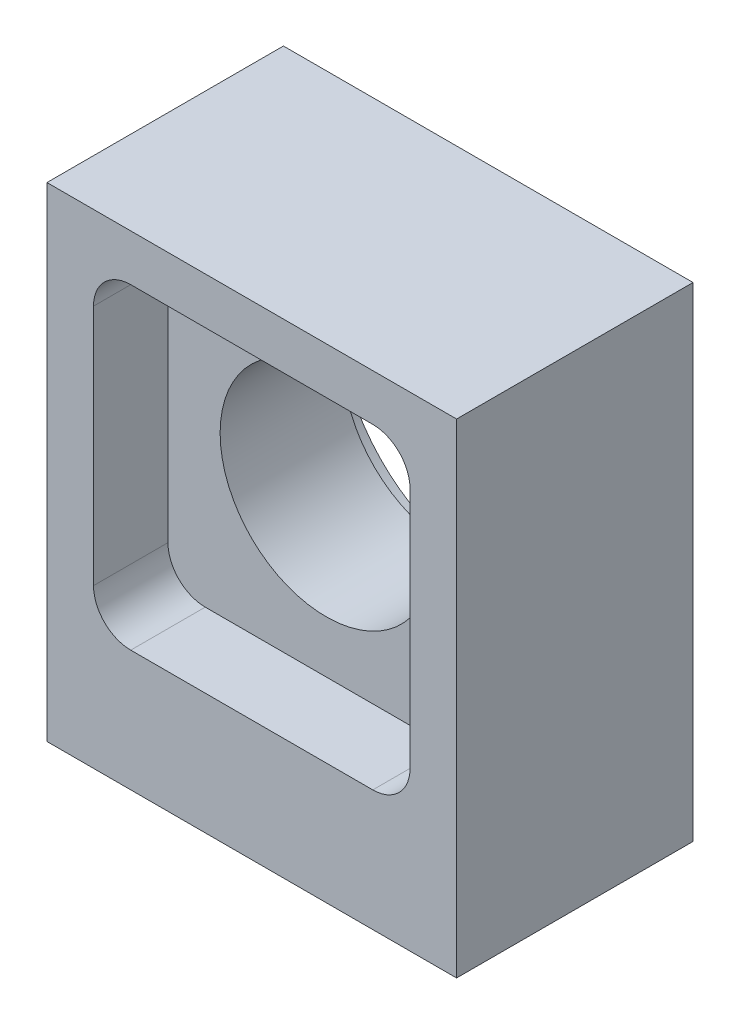
ISO-10303-21;
HEADER;
FILE_DESCRIPTION(('STEP AP214'),'2;1');
FILE_NAME('part.step','',(''),(''),'','','');
FILE_SCHEMA(('AUTOMOTIVE_DESIGN { 1 0 10303 214 1 1 1 1 }'));
ENDSEC;
DATA;
#1=APPLICATION_CONTEXT('core data for automotive mechanical design processes');
#2=APPLICATION_PROTOCOL_DEFINITION('international standard','automotive_design',2000,#1);
#3=PRODUCT_CONTEXT('',#1,'mechanical');
#4=PRODUCT('Part','Part','',(#3));
#5=PRODUCT_RELATED_PRODUCT_CATEGORY('part','',(#4));
#6=PRODUCT_DEFINITION_FORMATION('','',#4);
#7=PRODUCT_DEFINITION_CONTEXT('part definition',#1,'design');
#8=PRODUCT_DEFINITION('design','',#6,#7);
#9=PRODUCT_DEFINITION_SHAPE('','',#8);
#10=(LENGTH_UNIT() NAMED_UNIT(*) SI_UNIT(.MILLI.,.METRE.));
#11=(NAMED_UNIT(*) PLANE_ANGLE_UNIT() SI_UNIT($,.RADIAN.));
#12=(NAMED_UNIT(*) SI_UNIT($,.STERADIAN.) SOLID_ANGLE_UNIT());
#13=UNCERTAINTY_MEASURE_WITH_UNIT(LENGTH_MEASURE(1.E-05),#10,'distance_accuracy_value','');
#14=(GEOMETRIC_REPRESENTATION_CONTEXT(3) GLOBAL_UNCERTAINTY_ASSIGNED_CONTEXT((#13)) GLOBAL_UNIT_ASSIGNED_CONTEXT((#10,
#11,#12)) REPRESENTATION_CONTEXT('',''));
#15=CARTESIAN_POINT('',(0.,0.,0.));
#16=DIRECTION('',(0.,0.,1.));
#17=DIRECTION('',(1.,0.,0.));
#18=AXIS2_PLACEMENT_3D('',#15,#16,#17);
#19=CARTESIAN_POINT('',(11.,15.,-12.7));
#20=DIRECTION('',(0.,0.,1.));
#21=DIRECTION('',(1.,0.,0.));
#22=AXIS2_PLACEMENT_3D('',#19,#20,#21);
#23=CYLINDRICAL_SURFACE('',#22,5.7);
#24=CARTESIAN_POINT('',(11.,15.,-4.));
#25=DIRECTION('',(0.,0.,-1.));
#26=DIRECTION('',(-1.,0.,0.));
#27=AXIS2_PLACEMENT_3D('',#24,#25,#26);
#28=CIRCLE('',#27,5.7);
#29=CARTESIAN_POINT('',(5.3,15.,-4.));
#30=VERTEX_POINT('',#29);
#31=EDGE_CURVE('E223',#30,#30,#28,.F.);
#32=ORIENTED_EDGE('',*,*,#31,.T.);
#33=EDGE_LOOP('',(#32));
#34=FACE_BOUND('',#33,.T.);
#35=CARTESIAN_POINT('',(11.,15.,-10.6));
#36=DIRECTION('',(0.,0.,-1.));
#37=DIRECTION('',(-1.,0.,0.));
#38=AXIS2_PLACEMENT_3D('',#35,#36,#37);
#39=CIRCLE('',#38,5.7);
#40=CARTESIAN_POINT('',(5.3,15.,-10.6));
#41=VERTEX_POINT('',#40);
#42=EDGE_CURVE('E41',#41,#41,#39,.F.);
#43=ORIENTED_EDGE('',*,*,#42,.F.);
#44=EDGE_LOOP('',(#43));
#45=FACE_BOUND('',#44,.T.);
#46=ADVANCED_FACE('F37',(#34,#45),#23,.F.);
#47=CARTESIAN_POINT('',(0.,26.,0.));
#48=DIRECTION('',(1.,0.,0.));
#49=DIRECTION('',(0.,0.,-1.));
#50=AXIS2_PLACEMENT_3D('',#47,#48,#49);
#51=PLANE('',#50);
#52=DIRECTION('',(0.,0.,1.));
#53=VECTOR('',#52,1.);
#54=CARTESIAN_POINT('',(0.,0.,0.));
#55=LINE('',#54,#53);
#56=CARTESIAN_POINT('',(0.,0.,-12.7));
#57=VERTEX_POINT('',#56);
#58=CARTESIAN_POINT('',(0.,0.,0.));
#59=VERTEX_POINT('',#58);
#60=EDGE_CURVE('E192',#57,#59,#55,.T.);
#61=ORIENTED_EDGE('',*,*,#60,.T.);
#62=DIRECTION('',(0.,-1.,0.));
#63=VECTOR('',#62,1.);
#64=CARTESIAN_POINT('',(0.,26.,0.));
#65=LINE('',#64,#63);
#66=CARTESIAN_POINT('',(0.,26.,0.));
#67=VERTEX_POINT('',#66);
#68=EDGE_CURVE('E219',#67,#59,#65,.T.);
#69=ORIENTED_EDGE('',*,*,#68,.F.);
#70=DIRECTION('',(0.,0.,1.));
#71=VECTOR('',#70,1.);
#72=CARTESIAN_POINT('',(0.,26.,0.));
#73=LINE('',#72,#71);
#74=CARTESIAN_POINT('',(0.,26.,-12.7));
#75=VERTEX_POINT('',#74);
#76=EDGE_CURVE('E193',#75,#67,#73,.T.);
#77=ORIENTED_EDGE('',*,*,#76,.F.);
#78=DIRECTION('',(0.,-1.,0.));
#79=VECTOR('',#78,1.);
#80=CARTESIAN_POINT('',(0.,26.,-12.7));
#81=LINE('',#80,#79);
#82=EDGE_CURVE('E203',#75,#57,#81,.T.);
#83=ORIENTED_EDGE('',*,*,#82,.T.);
#84=EDGE_LOOP('',(#61,#69,#77,#83));
#85=FACE_BOUND('',#84,.T.);
#86=ADVANCED_FACE('F319',(#85),#51,.F.);
#87=CARTESIAN_POINT('',(0.,26.,0.));
#88=DIRECTION('',(0.,0.,-1.));
#89=DIRECTION('',(-1.,0.,0.));
#90=AXIS2_PLACEMENT_3D('',#87,#88,#89);
#91=PLANE('',#90);
#92=DIRECTION('',(1.,0.,0.));
#93=VECTOR('',#92,1.);
#94=CARTESIAN_POINT('',(2.5,6.5,0.));
#95=LINE('',#94,#93);
#96=CARTESIAN_POINT('',(4.5,6.5,0.));
#97=VERTEX_POINT('',#96);
#98=CARTESIAN_POINT('',(17.5,6.5,0.));
#99=VERTEX_POINT('',#98);
#100=EDGE_CURVE('E269',#97,#99,#95,.T.);
#101=ORIENTED_EDGE('',*,*,#100,.F.);
#102=CARTESIAN_POINT('',(4.5,8.5,0.));
#103=DIRECTION('',(0.,0.,-1.));
#104=DIRECTION('',(-1.,0.,0.));
#105=AXIS2_PLACEMENT_3D('',#102,#103,#104);
#106=CIRCLE('',#105,2.);
#107=CARTESIAN_POINT('',(2.5,8.5,0.));
#108=VERTEX_POINT('',#107);
#109=EDGE_CURVE('E255',#97,#108,#106,.T.);
#110=ORIENTED_EDGE('',*,*,#109,.T.);
#111=DIRECTION('',(0.,-1.,0.));
#112=VECTOR('',#111,1.);
#113=CARTESIAN_POINT('',(2.5,6.5,0.));
#114=LINE('',#113,#112);
#115=CARTESIAN_POINT('',(2.5,21.5,0.));
#116=VERTEX_POINT('',#115);
#117=EDGE_CURVE('E289',#116,#108,#114,.T.);
#118=ORIENTED_EDGE('',*,*,#117,.F.);
#119=CARTESIAN_POINT('',(4.5,21.5,0.));
#120=DIRECTION('',(0.,0.,-1.));
#121=DIRECTION('',(-1.,0.,0.));
#122=AXIS2_PLACEMENT_3D('',#119,#120,#121);
#123=CIRCLE('',#122,2.);
#124=CARTESIAN_POINT('',(4.5,23.5,0.));
#125=VERTEX_POINT('',#124);
#126=EDGE_CURVE('E11',#116,#125,#123,.T.);
#127=ORIENTED_EDGE('',*,*,#126,.T.);
#128=DIRECTION('',(-1.,0.,0.));
#129=VECTOR('',#128,1.);
#130=CARTESIAN_POINT('',(2.5,23.5,0.));
#131=LINE('',#130,#129);
#132=CARTESIAN_POINT('',(17.5,23.5,0.));
#133=VERTEX_POINT('',#132);
#134=EDGE_CURVE('E263',#133,#125,#131,.T.);
#135=ORIENTED_EDGE('',*,*,#134,.F.);
#136=CARTESIAN_POINT('',(17.5,21.5,0.));
#137=DIRECTION('',(0.,0.,-1.));
#138=DIRECTION('',(-1.,0.,0.));
#139=AXIS2_PLACEMENT_3D('',#136,#137,#138);
#140=CIRCLE('',#139,2.);
#141=CARTESIAN_POINT('',(19.5,21.5,0.));
#142=VERTEX_POINT('',#141);
#143=EDGE_CURVE('E46',#133,#142,#140,.T.);
#144=ORIENTED_EDGE('',*,*,#143,.T.);
#145=DIRECTION('',(0.,1.,0.));
#146=VECTOR('',#145,1.);
#147=CARTESIAN_POINT('',(19.5,6.5,0.));
#148=LINE('',#147,#146);
#149=CARTESIAN_POINT('',(19.5,8.5,0.));
#150=VERTEX_POINT('',#149);
#151=EDGE_CURVE('E262',#150,#142,#148,.T.);
#152=ORIENTED_EDGE('',*,*,#151,.F.);
#153=CARTESIAN_POINT('',(17.5,8.5,0.));
#154=DIRECTION('',(0.,0.,-1.));
#155=DIRECTION('',(-1.,0.,0.));
#156=AXIS2_PLACEMENT_3D('',#153,#154,#155);
#157=CIRCLE('',#156,2.);
#158=EDGE_CURVE('E253',#150,#99,#157,.T.);
#159=ORIENTED_EDGE('',*,*,#158,.T.);
#160=EDGE_LOOP('',(#101,#110,#118,#127,#135,#144,#152,#159));
#161=FACE_BOUND('',#160,.T.);
#162=DIRECTION('',(1.,0.,0.));
#163=VECTOR('',#162,1.);
#164=CARTESIAN_POINT('',(0.,0.,0.));
#165=LINE('',#164,#163);
#166=CARTESIAN_POINT('',(22.,0.,0.));
#167=VERTEX_POINT('',#166);
#168=EDGE_CURVE('E206',#59,#167,#165,.T.);
#169=ORIENTED_EDGE('',*,*,#168,.T.);
#170=DIRECTION('',(0.,-1.,0.));
#171=VECTOR('',#170,1.);
#172=CARTESIAN_POINT('',(22.,26.,0.));
#173=LINE('',#172,#171);
#174=CARTESIAN_POINT('',(22.,26.,0.));
#175=VERTEX_POINT('',#174);
#176=EDGE_CURVE('E216',#175,#167,#173,.T.);
#177=ORIENTED_EDGE('',*,*,#176,.F.);
#178=DIRECTION('',(1.,0.,0.));
#179=VECTOR('',#178,1.);
#180=CARTESIAN_POINT('',(0.,26.,0.));
#181=LINE('',#180,#179);
#182=EDGE_CURVE('E196',#67,#175,#181,.T.);
#183=ORIENTED_EDGE('',*,*,#182,.F.);
#184=ORIENTED_EDGE('',*,*,#68,.T.);
#185=EDGE_LOOP('',(#169,#177,#183,#184));
#186=FACE_BOUND('',#185,.T.);
#187=ADVANCED_FACE('F260',(#161,#186),#91,.F.);
#188=CARTESIAN_POINT('',(22.,26.,0.));
#189=DIRECTION('',(-1.,0.,0.));
#190=DIRECTION('',(0.,0.,1.));
#191=AXIS2_PLACEMENT_3D('',#188,#189,#190);
#192=PLANE('',#191);
#193=DIRECTION('',(0.,0.,-1.));
#194=VECTOR('',#193,1.);
#195=CARTESIAN_POINT('',(22.,0.,0.));
#196=LINE('',#195,#194);
#197=CARTESIAN_POINT('',(22.,0.,-12.7));
#198=VERTEX_POINT('',#197);
#199=EDGE_CURVE('E208',#167,#198,#196,.T.);
#200=ORIENTED_EDGE('',*,*,#199,.T.);
#201=DIRECTION('',(0.,-1.,0.));
#202=VECTOR('',#201,1.);
#203=CARTESIAN_POINT('',(22.,26.,-12.7));
#204=LINE('',#203,#202);
#205=CARTESIAN_POINT('',(22.,26.,-12.7));
#206=VERTEX_POINT('',#205);
#207=EDGE_CURVE('E213',#206,#198,#204,.T.);
#208=ORIENTED_EDGE('',*,*,#207,.F.);
#209=DIRECTION('',(0.,0.,-1.));
#210=VECTOR('',#209,1.);
#211=CARTESIAN_POINT('',(22.,26.,0.));
#212=LINE('',#211,#210);
#213=EDGE_CURVE('E199',#175,#206,#212,.T.);
#214=ORIENTED_EDGE('',*,*,#213,.F.);
#215=ORIENTED_EDGE('',*,*,#176,.T.);
#216=EDGE_LOOP('',(#200,#208,#214,#215));
#217=FACE_BOUND('',#216,.T.);
#218=ADVANCED_FACE('F328',(#217),#192,.F.);
#219=CARTESIAN_POINT('',(0.,26.,-12.7));
#220=DIRECTION('',(0.,0.,1.));
#221=DIRECTION('',(1.,0.,0.));
#222=AXIS2_PLACEMENT_3D('',#219,#220,#221);
#223=PLANE('',#222);
#224=CARTESIAN_POINT('',(11.,15.,-12.7));
#225=DIRECTION('',(0.,0.,-1.));
#226=DIRECTION('',(-1.,0.,0.));
#227=AXIS2_PLACEMENT_3D('',#224,#225,#226);
#228=CIRCLE('',#227,8.05);
#229=CARTESIAN_POINT('',(2.95,15.,-12.7));
#230=VERTEX_POINT('',#229);
#231=EDGE_CURVE('E659',#230,#230,#228,.T.);
#232=ORIENTED_EDGE('',*,*,#231,.F.);
#233=EDGE_LOOP('',(#232));
#234=FACE_BOUND('',#233,.T.);
#235=DIRECTION('',(-1.,0.,0.));
#236=VECTOR('',#235,1.);
#237=CARTESIAN_POINT('',(0.,0.,-12.7));
#238=LINE('',#237,#236);
#239=EDGE_CURVE('E197',#198,#57,#238,.T.);
#240=ORIENTED_EDGE('',*,*,#239,.T.);
#241=ORIENTED_EDGE('',*,*,#82,.F.);
#242=DIRECTION('',(-1.,0.,0.));
#243=VECTOR('',#242,1.);
#244=CARTESIAN_POINT('',(0.,26.,-12.7));
#245=LINE('',#244,#243);
#246=EDGE_CURVE('E201',#206,#75,#245,.T.);
#247=ORIENTED_EDGE('',*,*,#246,.F.);
#248=ORIENTED_EDGE('',*,*,#207,.T.);
#249=EDGE_LOOP('',(#240,#241,#247,#248));
#250=FACE_BOUND('',#249,.T.);
#251=ADVANCED_FACE('F324',(#234,#250),#223,.F.);
#252=CARTESIAN_POINT('',(0.,26.,0.));
#253=DIRECTION('',(0.,-1.,0.));
#254=DIRECTION('',(0.,0.,-1.));
#255=AXIS2_PLACEMENT_3D('',#252,#253,#254);
#256=PLANE('',#255);
#257=ORIENTED_EDGE('',*,*,#76,.T.);
#258=ORIENTED_EDGE('',*,*,#182,.T.);
#259=ORIENTED_EDGE('',*,*,#213,.T.);
#260=ORIENTED_EDGE('',*,*,#246,.T.);
#261=EDGE_LOOP('',(#257,#258,#259,#260));
#262=FACE_BOUND('',#261,.T.);
#263=ADVANCED_FACE('F304',(#262),#256,.F.);
#264=CARTESIAN_POINT('',(0.,0.,0.));
#265=DIRECTION('',(0.,-1.,0.));
#266=DIRECTION('',(0.,0.,-1.));
#267=AXIS2_PLACEMENT_3D('',#264,#265,#266);
#268=PLANE('',#267);
#269=CARTESIAN_POINT('',(11.,0.,-6.35));
#270=DIRECTION('',(0.,-1.,0.));
#271=DIRECTION('',(0.,0.,-1.));
#272=AXIS2_PLACEMENT_3D('',#269,#270,#271);
#273=CIRCLE('',#272,1.525);
#274=CARTESIAN_POINT('',(11.,0.,-7.875));
#275=VERTEX_POINT('',#274);
#276=EDGE_CURVE('E156',#275,#275,#273,.T.);
#277=ORIENTED_EDGE('',*,*,#276,.F.);
#278=EDGE_LOOP('',(#277));
#279=FACE_BOUND('',#278,.T.);
#280=CARTESIAN_POINT('',(4.,0.,-3.));
#281=DIRECTION('',(0.,-1.,0.));
#282=DIRECTION('',(0.,0.,-1.));
#283=AXIS2_PLACEMENT_3D('',#280,#281,#282);
#284=CIRCLE('',#283,1.525);
#285=CARTESIAN_POINT('',(4.,0.,-4.525));
#286=VERTEX_POINT('',#285);
#287=EDGE_CURVE('E149',#286,#286,#284,.T.);
#288=ORIENTED_EDGE('',*,*,#287,.F.);
#289=EDGE_LOOP('',(#288));
#290=FACE_BOUND('',#289,.T.);
#291=CARTESIAN_POINT('',(4.,0.,-9.7));
#292=DIRECTION('',(0.,-1.,0.));
#293=DIRECTION('',(0.,0.,-1.));
#294=AXIS2_PLACEMENT_3D('',#291,#292,#293);
#295=CIRCLE('',#294,1.525);
#296=CARTESIAN_POINT('',(4.,0.,-11.225));
#297=VERTEX_POINT('',#296);
#298=EDGE_CURVE('E165',#297,#297,#295,.T.);
#299=ORIENTED_EDGE('',*,*,#298,.F.);
#300=EDGE_LOOP('',(#299));
#301=FACE_BOUND('',#300,.T.);
#302=CARTESIAN_POINT('',(18.,0.,-9.7));
#303=DIRECTION('',(0.,-1.,0.));
#304=DIRECTION('',(0.,0.,-1.));
#305=AXIS2_PLACEMENT_3D('',#302,#303,#304);
#306=CIRCLE('',#305,1.525);
#307=CARTESIAN_POINT('',(18.,0.,-11.225));
#308=VERTEX_POINT('',#307);
#309=EDGE_CURVE('E174',#308,#308,#306,.T.);
#310=ORIENTED_EDGE('',*,*,#309,.F.);
#311=EDGE_LOOP('',(#310));
#312=FACE_BOUND('',#311,.T.);
#313=CARTESIAN_POINT('',(18.,0.,-3.));
#314=DIRECTION('',(0.,-1.,0.));
#315=DIRECTION('',(0.,0.,-1.));
#316=AXIS2_PLACEMENT_3D('',#313,#314,#315);
#317=CIRCLE('',#316,1.525);
#318=CARTESIAN_POINT('',(18.,0.,-4.525));
#319=VERTEX_POINT('',#318);
#320=EDGE_CURVE('E183',#319,#319,#317,.T.);
#321=ORIENTED_EDGE('',*,*,#320,.F.);
#322=EDGE_LOOP('',(#321));
#323=FACE_BOUND('',#322,.T.);
#324=ORIENTED_EDGE('',*,*,#60,.F.);
#325=ORIENTED_EDGE('',*,*,#239,.F.);
#326=ORIENTED_EDGE('',*,*,#199,.F.);
#327=ORIENTED_EDGE('',*,*,#168,.F.);
#328=EDGE_LOOP('',(#324,#325,#326,#327));
#329=FACE_BOUND('',#328,.T.);
#330=ADVANCED_FACE('F300',(#279,#290,#301,#312,#323,#329),#268,.T.);
#331=CARTESIAN_POINT('',(18.,5.,-3.));
#332=DIRECTION('',(0.,-1.,0.));
#333=DIRECTION('',(0.,0.,-1.));
#334=AXIS2_PLACEMENT_3D('',#331,#332,#333);
#335=CONICAL_SURFACE('',#334,1.25,1.02974425867665);
#336=CARTESIAN_POINT('',(18.,5.75107577378445,-3.));
#337=VERTEX_POINT('',#336);
#338=VERTEX_LOOP('',#337);
#339=FACE_BOUND('',#338,.T.);
#340=CARTESIAN_POINT('',(18.,5.,-3.));
#341=DIRECTION('',(0.,-1.,0.));
#342=DIRECTION('',(0.,0.,-1.));
#343=AXIS2_PLACEMENT_3D('',#340,#341,#342);
#344=CIRCLE('',#343,1.25);
#345=CARTESIAN_POINT('',(18.,5.,-4.25));
#346=VERTEX_POINT('',#345);
#347=EDGE_CURVE('E189',#346,#346,#344,.T.);
#348=ORIENTED_EDGE('',*,*,#347,.T.);
#349=EDGE_LOOP('',(#348));
#350=FACE_BOUND('',#349,.T.);
#351=ADVANCED_FACE('F303',(#339,#350),#335,.F.);
#352=CARTESIAN_POINT('',(18.,0.,-3.));
#353=DIRECTION('',(0.,-1.,0.));
#354=DIRECTION('',(0.,0.,-1.));
#355=AXIS2_PLACEMENT_3D('',#352,#353,#354);
#356=CYLINDRICAL_SURFACE('',#355,1.25);
#357=ORIENTED_EDGE('',*,*,#347,.F.);
#358=EDGE_LOOP('',(#357));
#359=FACE_BOUND('',#358,.T.);
#360=CARTESIAN_POINT('',(18.,0.275000000000001,-3.));
#361=DIRECTION('',(0.,-1.,0.));
#362=DIRECTION('',(0.,0.,-1.));
#363=AXIS2_PLACEMENT_3D('',#360,#361,#362);
#364=CIRCLE('',#363,1.25);
#365=CARTESIAN_POINT('',(18.,0.275000000000001,-4.25));
#366=VERTEX_POINT('',#365);
#367=EDGE_CURVE('E186',#366,#366,#364,.T.);
#368=ORIENTED_EDGE('',*,*,#367,.T.);
#369=EDGE_LOOP('',(#368));
#370=FACE_BOUND('',#369,.T.);
#371=ADVANCED_FACE('F394',(#359,#370),#356,.F.);
#372=CARTESIAN_POINT('',(18.,0.,-3.));
#373=DIRECTION('',(0.,-1.,0.));
#374=DIRECTION('',(0.,0.,-1.));
#375=AXIS2_PLACEMENT_3D('',#372,#373,#374);
#376=CONICAL_SURFACE('',#375,1.525,0.785398163397448);
#377=ORIENTED_EDGE('',*,*,#367,.F.);
#378=EDGE_LOOP('',(#377));
#379=FACE_BOUND('',#378,.T.);
#380=ORIENTED_EDGE('',*,*,#320,.T.);
#381=EDGE_LOOP('',(#380));
#382=FACE_BOUND('',#381,.T.);
#383=ADVANCED_FACE('F390',(#379,#382),#376,.F.);
#384=CARTESIAN_POINT('',(18.,5.,-9.7));
#385=DIRECTION('',(0.,-1.,0.));
#386=DIRECTION('',(0.,0.,-1.));
#387=AXIS2_PLACEMENT_3D('',#384,#385,#386);
#388=CONICAL_SURFACE('',#387,1.25,1.02974425867665);
#389=CARTESIAN_POINT('',(18.,5.75107577378445,-9.7));
#390=VERTEX_POINT('',#389);
#391=VERTEX_LOOP('',#390);
#392=FACE_BOUND('',#391,.T.);
#393=CARTESIAN_POINT('',(18.,5.,-9.7));
#394=DIRECTION('',(0.,-1.,0.));
#395=DIRECTION('',(0.,0.,-1.));
#396=AXIS2_PLACEMENT_3D('',#393,#394,#395);
#397=CIRCLE('',#396,1.25);
#398=CARTESIAN_POINT('',(18.,5.,-10.95));
#399=VERTEX_POINT('',#398);
#400=EDGE_CURVE('E180',#399,#399,#397,.T.);
#401=ORIENTED_EDGE('',*,*,#400,.T.);
#402=EDGE_LOOP('',(#401));
#403=FACE_BOUND('',#402,.T.);
#404=ADVANCED_FACE('F386',(#392,#403),#388,.F.);
#405=CARTESIAN_POINT('',(18.,0.,-9.7));
#406=DIRECTION('',(0.,-1.,0.));
#407=DIRECTION('',(0.,0.,-1.));
#408=AXIS2_PLACEMENT_3D('',#405,#406,#407);
#409=CYLINDRICAL_SURFACE('',#408,1.25);
#410=ORIENTED_EDGE('',*,*,#400,.F.);
#411=EDGE_LOOP('',(#410));
#412=FACE_BOUND('',#411,.T.);
#413=CARTESIAN_POINT('',(18.,0.275000000000001,-9.7));
#414=DIRECTION('',(0.,-1.,0.));
#415=DIRECTION('',(0.,0.,-1.));
#416=AXIS2_PLACEMENT_3D('',#413,#414,#415);
#417=CIRCLE('',#416,1.25);
#418=CARTESIAN_POINT('',(18.,0.275000000000001,-10.95));
#419=VERTEX_POINT('',#418);
#420=EDGE_CURVE('E177',#419,#419,#417,.T.);
#421=ORIENTED_EDGE('',*,*,#420,.T.);
#422=EDGE_LOOP('',(#421));
#423=FACE_BOUND('',#422,.T.);
#424=ADVANCED_FACE('F382',(#412,#423),#409,.F.);
#425=CARTESIAN_POINT('',(18.,0.,-9.7));
#426=DIRECTION('',(0.,-1.,0.));
#427=DIRECTION('',(0.,0.,-1.));
#428=AXIS2_PLACEMENT_3D('',#425,#426,#427);
#429=CONICAL_SURFACE('',#428,1.525,0.785398163397448);
#430=ORIENTED_EDGE('',*,*,#420,.F.);
#431=EDGE_LOOP('',(#430));
#432=FACE_BOUND('',#431,.T.);
#433=ORIENTED_EDGE('',*,*,#309,.T.);
#434=EDGE_LOOP('',(#433));
#435=FACE_BOUND('',#434,.T.);
#436=ADVANCED_FACE('F378',(#432,#435),#429,.F.);
#437=CARTESIAN_POINT('',(4.,5.,-9.7));
#438=DIRECTION('',(0.,-1.,0.));
#439=DIRECTION('',(0.,0.,-1.));
#440=AXIS2_PLACEMENT_3D('',#437,#438,#439);
#441=CONICAL_SURFACE('',#440,1.25,1.02974425867665);
#442=CARTESIAN_POINT('',(4.,5.75107577378445,-9.7));
#443=VERTEX_POINT('',#442);
#444=VERTEX_LOOP('',#443);
#445=FACE_BOUND('',#444,.T.);
#446=CARTESIAN_POINT('',(4.,5.,-9.7));
#447=DIRECTION('',(0.,-1.,0.));
#448=DIRECTION('',(0.,0.,-1.));
#449=AXIS2_PLACEMENT_3D('',#446,#447,#448);
#450=CIRCLE('',#449,1.25);
#451=CARTESIAN_POINT('',(4.,5.,-10.95));
#452=VERTEX_POINT('',#451);
#453=EDGE_CURVE('E171',#452,#452,#450,.T.);
#454=ORIENTED_EDGE('',*,*,#453,.T.);
#455=EDGE_LOOP('',(#454));
#456=FACE_BOUND('',#455,.T.);
#457=ADVANCED_FACE('F374',(#445,#456),#441,.F.);
#458=CARTESIAN_POINT('',(4.,0.,-9.7));
#459=DIRECTION('',(0.,-1.,0.));
#460=DIRECTION('',(0.,0.,-1.));
#461=AXIS2_PLACEMENT_3D('',#458,#459,#460);
#462=CYLINDRICAL_SURFACE('',#461,1.25);
#463=ORIENTED_EDGE('',*,*,#453,.F.);
#464=EDGE_LOOP('',(#463));
#465=FACE_BOUND('',#464,.T.);
#466=CARTESIAN_POINT('',(4.,0.275000000000001,-9.7));
#467=DIRECTION('',(0.,-1.,0.));
#468=DIRECTION('',(0.,0.,-1.));
#469=AXIS2_PLACEMENT_3D('',#466,#467,#468);
#470=CIRCLE('',#469,1.25);
#471=CARTESIAN_POINT('',(4.,0.275000000000001,-10.95));
#472=VERTEX_POINT('',#471);
#473=EDGE_CURVE('E168',#472,#472,#470,.T.);
#474=ORIENTED_EDGE('',*,*,#473,.T.);
#475=EDGE_LOOP('',(#474));
#476=FACE_BOUND('',#475,.T.);
#477=ADVANCED_FACE('F370',(#465,#476),#462,.F.);
#478=CARTESIAN_POINT('',(4.,0.,-9.7));
#479=DIRECTION('',(0.,-1.,0.));
#480=DIRECTION('',(0.,0.,-1.));
#481=AXIS2_PLACEMENT_3D('',#478,#479,#480);
#482=CONICAL_SURFACE('',#481,1.525,0.785398163397448);
#483=ORIENTED_EDGE('',*,*,#473,.F.);
#484=EDGE_LOOP('',(#483));
#485=FACE_BOUND('',#484,.T.);
#486=ORIENTED_EDGE('',*,*,#298,.T.);
#487=EDGE_LOOP('',(#486));
#488=FACE_BOUND('',#487,.T.);
#489=ADVANCED_FACE('F366',(#485,#488),#482,.F.);
#490=CARTESIAN_POINT('',(4.,5.,-3.));
#491=DIRECTION('',(0.,-1.,0.));
#492=DIRECTION('',(0.,0.,-1.));
#493=AXIS2_PLACEMENT_3D('',#490,#491,#492);
#494=CONICAL_SURFACE('',#493,1.25,1.02974425867665);
#495=CARTESIAN_POINT('',(4.,5.75107577378445,-3.));
#496=VERTEX_POINT('',#495);
#497=VERTEX_LOOP('',#496);
#498=FACE_BOUND('',#497,.T.);
#499=CARTESIAN_POINT('',(4.,5.,-3.));
#500=DIRECTION('',(0.,-1.,0.));
#501=DIRECTION('',(0.,0.,-1.));
#502=AXIS2_PLACEMENT_3D('',#499,#500,#501);
#503=CIRCLE('',#502,1.25);
#504=CARTESIAN_POINT('',(4.,5.,-4.25));
#505=VERTEX_POINT('',#504);
#506=EDGE_CURVE('E162',#505,#505,#503,.T.);
#507=ORIENTED_EDGE('',*,*,#506,.T.);
#508=EDGE_LOOP('',(#507));
#509=FACE_BOUND('',#508,.T.);
#510=ADVANCED_FACE('F362',(#498,#509),#494,.F.);
#511=CARTESIAN_POINT('',(4.,0.,-3.));
#512=DIRECTION('',(0.,-1.,0.));
#513=DIRECTION('',(0.,0.,-1.));
#514=AXIS2_PLACEMENT_3D('',#511,#512,#513);
#515=CYLINDRICAL_SURFACE('',#514,1.25);
#516=ORIENTED_EDGE('',*,*,#506,.F.);
#517=EDGE_LOOP('',(#516));
#518=FACE_BOUND('',#517,.T.);
#519=CARTESIAN_POINT('',(4.,0.275000000000001,-3.));
#520=DIRECTION('',(0.,-1.,0.));
#521=DIRECTION('',(0.,0.,-1.));
#522=AXIS2_PLACEMENT_3D('',#519,#520,#521);
#523=CIRCLE('',#522,1.25);
#524=CARTESIAN_POINT('',(4.,0.275000000000001,-4.25));
#525=VERTEX_POINT('',#524);
#526=EDGE_CURVE('E153',#525,#525,#523,.T.);
#527=ORIENTED_EDGE('',*,*,#526,.T.);
#528=EDGE_LOOP('',(#527));
#529=FACE_BOUND('',#528,.T.);
#530=ADVANCED_FACE('F358',(#518,#529),#515,.F.);
#531=CARTESIAN_POINT('',(4.,0.,-3.));
#532=DIRECTION('',(0.,-1.,0.));
#533=DIRECTION('',(0.,0.,-1.));
#534=AXIS2_PLACEMENT_3D('',#531,#532,#533);
#535=CONICAL_SURFACE('',#534,1.525,0.785398163397448);
#536=ORIENTED_EDGE('',*,*,#526,.F.);
#537=EDGE_LOOP('',(#536));
#538=FACE_BOUND('',#537,.T.);
#539=ORIENTED_EDGE('',*,*,#287,.T.);
#540=EDGE_LOOP('',(#539));
#541=FACE_BOUND('',#540,.T.);
#542=ADVANCED_FACE('F143',(#538,#541),#535,.F.);
#543=CARTESIAN_POINT('',(11.,5.,-6.35));
#544=DIRECTION('',(0.,-1.,0.));
#545=DIRECTION('',(0.,0.,-1.));
#546=AXIS2_PLACEMENT_3D('',#543,#544,#545);
#547=CONICAL_SURFACE('',#546,1.25,1.02974425867665);
#548=CARTESIAN_POINT('',(11.,5.75107577378445,-6.35));
#549=VERTEX_POINT('',#548);
#550=VERTEX_LOOP('',#549);
#551=FACE_BOUND('',#550,.T.);
#552=CARTESIAN_POINT('',(11.,5.,-6.35));
#553=DIRECTION('',(0.,-1.,0.));
#554=DIRECTION('',(0.,0.,-1.));
#555=AXIS2_PLACEMENT_3D('',#552,#553,#554);
#556=CIRCLE('',#555,1.25);
#557=CARTESIAN_POINT('',(11.,5.,-7.6));
#558=VERTEX_POINT('',#557);
#559=EDGE_CURVE('E147',#558,#558,#556,.T.);
#560=ORIENTED_EDGE('',*,*,#559,.T.);
#561=EDGE_LOOP('',(#560));
#562=FACE_BOUND('',#561,.T.);
#563=ADVANCED_FACE('F139',(#551,#562),#547,.F.);
#564=CARTESIAN_POINT('',(11.,0.,-6.35));
#565=DIRECTION('',(0.,-1.,0.));
#566=DIRECTION('',(0.,0.,-1.));
#567=AXIS2_PLACEMENT_3D('',#564,#565,#566);
#568=CYLINDRICAL_SURFACE('',#567,1.24999999999999);
#569=ORIENTED_EDGE('',*,*,#559,.F.);
#570=EDGE_LOOP('',(#569));
#571=FACE_BOUND('',#570,.T.);
#572=CARTESIAN_POINT('',(11.,0.274999999999997,-6.35));
#573=DIRECTION('',(0.,-1.,0.));
#574=DIRECTION('',(0.,0.,-1.));
#575=AXIS2_PLACEMENT_3D('',#572,#573,#574);
#576=CIRCLE('',#575,1.24999999999999);
#577=CARTESIAN_POINT('',(11.,0.274999999999997,-7.59999999999999));
#578=VERTEX_POINT('',#577);
#579=EDGE_CURVE('E150',#578,#578,#576,.T.);
#580=ORIENTED_EDGE('',*,*,#579,.T.);
#581=EDGE_LOOP('',(#580));
#582=FACE_BOUND('',#581,.T.);
#583=ADVANCED_FACE('F142',(#571,#582),#568,.F.);
#584=CARTESIAN_POINT('',(11.,0.,-6.35));
#585=DIRECTION('',(0.,-1.,0.));
#586=DIRECTION('',(0.,0.,-1.));
#587=AXIS2_PLACEMENT_3D('',#584,#585,#586);
#588=CONICAL_SURFACE('',#587,1.525,0.78539816339747);
#589=ORIENTED_EDGE('',*,*,#579,.F.);
#590=EDGE_LOOP('',(#589));
#591=FACE_BOUND('',#590,.T.);
#592=ORIENTED_EDGE('',*,*,#276,.T.);
#593=EDGE_LOOP('',(#592));
#594=FACE_BOUND('',#593,.T.);
#595=ADVANCED_FACE('F298',(#591,#594),#588,.F.);
#596=CARTESIAN_POINT('',(0.,0.,-4.));
#597=DIRECTION('',(0.,0.,-1.));
#598=DIRECTION('',(-1.,0.,0.));
#599=AXIS2_PLACEMENT_3D('',#596,#597,#598);
#600=PLANE('',#599);
#601=DIRECTION('',(1.,0.,0.));
#602=VECTOR('',#601,1.);
#603=CARTESIAN_POINT('',(2.5,6.5,-4.));
#604=LINE('',#603,#602);
#605=CARTESIAN_POINT('',(4.5,6.5,-4.));
#606=VERTEX_POINT('',#605);
#607=CARTESIAN_POINT('',(17.5,6.5,-4.));
#608=VERTEX_POINT('',#607);
#609=EDGE_CURVE('E285',#606,#608,#604,.T.);
#610=ORIENTED_EDGE('',*,*,#609,.T.);
#611=CARTESIAN_POINT('',(17.5,8.5,-4.));
#612=DIRECTION('',(0.,0.,-1.));
#613=DIRECTION('',(-1.,0.,0.));
#614=AXIS2_PLACEMENT_3D('',#611,#612,#613);
#615=CIRCLE('',#614,2.);
#616=CARTESIAN_POINT('',(19.5,8.5,-4.));
#617=VERTEX_POINT('',#616);
#618=EDGE_CURVE('E242',#608,#617,#615,.F.);
#619=ORIENTED_EDGE('',*,*,#618,.T.);
#620=DIRECTION('',(0.,1.,0.));
#621=VECTOR('',#620,1.);
#622=CARTESIAN_POINT('',(19.5,6.5,-4.));
#623=LINE('',#622,#621);
#624=CARTESIAN_POINT('',(19.5,21.5,-4.));
#625=VERTEX_POINT('',#624);
#626=EDGE_CURVE('E280',#617,#625,#623,.T.);
#627=ORIENTED_EDGE('',*,*,#626,.T.);
#628=CARTESIAN_POINT('',(17.5,21.5,-4.));
#629=DIRECTION('',(0.,0.,-1.));
#630=DIRECTION('',(-1.,0.,0.));
#631=AXIS2_PLACEMENT_3D('',#628,#629,#630);
#632=CIRCLE('',#631,2.);
#633=CARTESIAN_POINT('',(17.5,23.5,-4.));
#634=VERTEX_POINT('',#633);
#635=EDGE_CURVE('E238',#625,#634,#632,.F.);
#636=ORIENTED_EDGE('',*,*,#635,.T.);
#637=DIRECTION('',(-1.,0.,0.));
#638=VECTOR('',#637,1.);
#639=CARTESIAN_POINT('',(2.5,23.5,-4.));
#640=LINE('',#639,#638);
#641=CARTESIAN_POINT('',(4.5,23.5,-4.));
#642=VERTEX_POINT('',#641);
#643=EDGE_CURVE('E226',#634,#642,#640,.T.);
#644=ORIENTED_EDGE('',*,*,#643,.T.);
#645=CARTESIAN_POINT('',(4.5,21.5,-4.));
#646=DIRECTION('',(0.,0.,-1.));
#647=DIRECTION('',(-1.,0.,0.));
#648=AXIS2_PLACEMENT_3D('',#645,#646,#647);
#649=CIRCLE('',#648,2.);
#650=CARTESIAN_POINT('',(2.5,21.5,-4.));
#651=VERTEX_POINT('',#650);
#652=EDGE_CURVE('E236',#642,#651,#649,.F.);
#653=ORIENTED_EDGE('',*,*,#652,.T.);
#654=DIRECTION('',(0.,-1.,0.));
#655=VECTOR('',#654,1.);
#656=CARTESIAN_POINT('',(2.5,6.5,-4.));
#657=LINE('',#656,#655);
#658=CARTESIAN_POINT('',(2.5,8.5,-4.));
#659=VERTEX_POINT('',#658);
#660=EDGE_CURVE('E294',#651,#659,#657,.T.);
#661=ORIENTED_EDGE('',*,*,#660,.T.);
#662=CARTESIAN_POINT('',(4.5,8.5,-4.));
#663=DIRECTION('',(0.,0.,-1.));
#664=DIRECTION('',(-1.,0.,0.));
#665=AXIS2_PLACEMENT_3D('',#662,#663,#664);
#666=CIRCLE('',#665,2.);
#667=EDGE_CURVE('E240',#659,#606,#666,.F.);
#668=ORIENTED_EDGE('',*,*,#667,.T.);
#669=EDGE_LOOP('',(#610,#619,#627,#636,#644,#653,#661,#668));
#670=FACE_BOUND('',#669,.T.);
#671=ORIENTED_EDGE('',*,*,#31,.F.);
#672=EDGE_LOOP('',(#671));
#673=FACE_BOUND('',#672,.T.);
#674=ADVANCED_FACE('F277',(#670,#673),#600,.F.);
#675=CARTESIAN_POINT('',(2.5,6.5,-4.));
#676=DIRECTION('',(-1.,0.,0.));
#677=DIRECTION('',(0.,0.,1.));
#678=AXIS2_PLACEMENT_3D('',#675,#676,#677);
#679=PLANE('',#678);
#680=ORIENTED_EDGE('',*,*,#117,.T.);
#681=DIRECTION('',(0.,0.,1.));
#682=VECTOR('',#681,1.);
#683=CARTESIAN_POINT('',(2.5,8.5,-4.));
#684=LINE('',#683,#682);
#685=EDGE_CURVE('E247',#108,#659,#684,.F.);
#686=ORIENTED_EDGE('',*,*,#685,.T.);
#687=ORIENTED_EDGE('',*,*,#660,.F.);
#688=DIRECTION('',(0.,0.,1.));
#689=VECTOR('',#688,1.);
#690=CARTESIAN_POINT('',(2.5,21.5,0.));
#691=LINE('',#690,#689);
#692=EDGE_CURVE('E244',#651,#116,#691,.T.);
#693=ORIENTED_EDGE('',*,*,#692,.T.);
#694=EDGE_LOOP('',(#680,#686,#687,#693));
#695=FACE_BOUND('',#694,.T.);
#696=ADVANCED_FACE('F349',(#695),#679,.F.);
#697=CARTESIAN_POINT('',(2.5,23.5,-4.));
#698=DIRECTION('',(0.,1.,0.));
#699=DIRECTION('',(0.,0.,1.));
#700=AXIS2_PLACEMENT_3D('',#697,#698,#699);
#701=PLANE('',#700);
#702=ORIENTED_EDGE('',*,*,#643,.F.);
#703=DIRECTION('',(0.,0.,1.));
#704=VECTOR('',#703,1.);
#705=CARTESIAN_POINT('',(17.5,23.5,0.));
#706=LINE('',#705,#704);
#707=EDGE_CURVE('E251',#634,#133,#706,.T.);
#708=ORIENTED_EDGE('',*,*,#707,.T.);
#709=ORIENTED_EDGE('',*,*,#134,.T.);
#710=DIRECTION('',(0.,0.,1.));
#711=VECTOR('',#710,1.);
#712=CARTESIAN_POINT('',(4.5,23.5,-4.));
#713=LINE('',#712,#711);
#714=EDGE_CURVE('E249',#125,#642,#713,.F.);
#715=ORIENTED_EDGE('',*,*,#714,.T.);
#716=EDGE_LOOP('',(#702,#708,#709,#715));
#717=FACE_BOUND('',#716,.T.);
#718=ADVANCED_FACE('F282',(#717),#701,.F.);
#719=CARTESIAN_POINT('',(19.5,6.5,-4.));
#720=DIRECTION('',(1.,0.,0.));
#721=DIRECTION('',(0.,0.,-1.));
#722=AXIS2_PLACEMENT_3D('',#719,#720,#721);
#723=PLANE('',#722);
#724=ORIENTED_EDGE('',*,*,#626,.F.);
#725=DIRECTION('',(0.,0.,1.));
#726=VECTOR('',#725,1.);
#727=CARTESIAN_POINT('',(19.5,8.5,0.));
#728=LINE('',#727,#726);
#729=EDGE_CURVE('E228',#617,#150,#728,.T.);
#730=ORIENTED_EDGE('',*,*,#729,.T.);
#731=ORIENTED_EDGE('',*,*,#151,.T.);
#732=DIRECTION('',(0.,0.,1.));
#733=VECTOR('',#732,1.);
#734=CARTESIAN_POINT('',(19.5,21.5,-4.));
#735=LINE('',#734,#733);
#736=EDGE_CURVE('E222',#142,#625,#735,.F.);
#737=ORIENTED_EDGE('',*,*,#736,.T.);
#738=EDGE_LOOP('',(#724,#730,#731,#737));
#739=FACE_BOUND('',#738,.T.);
#740=ADVANCED_FACE('F266',(#739),#723,.F.);
#741=CARTESIAN_POINT('',(2.5,6.5,-4.));
#742=DIRECTION('',(0.,-1.,0.));
#743=DIRECTION('',(0.,0.,-1.));
#744=AXIS2_PLACEMENT_3D('',#741,#742,#743);
#745=PLANE('',#744);
#746=ORIENTED_EDGE('',*,*,#100,.T.);
#747=DIRECTION('',(0.,0.,1.));
#748=VECTOR('',#747,1.);
#749=CARTESIAN_POINT('',(17.5,6.5,-4.));
#750=LINE('',#749,#748);
#751=EDGE_CURVE('E234',#99,#608,#750,.F.);
#752=ORIENTED_EDGE('',*,*,#751,.T.);
#753=ORIENTED_EDGE('',*,*,#609,.F.);
#754=DIRECTION('',(0.,0.,1.));
#755=VECTOR('',#754,1.);
#756=CARTESIAN_POINT('',(4.5,6.5,0.));
#757=LINE('',#756,#755);
#758=EDGE_CURVE('E231',#606,#97,#757,.T.);
#759=ORIENTED_EDGE('',*,*,#758,.T.);
#760=EDGE_LOOP('',(#746,#752,#753,#759));
#761=FACE_BOUND('',#760,.T.);
#762=ADVANCED_FACE('F495',(#761),#745,.F.);
#763=CARTESIAN_POINT('',(17.5,8.5,-4.));
#764=DIRECTION('',(0.,0.,-1.));
#765=DIRECTION('',(-1.,0.,0.));
#766=AXIS2_PLACEMENT_3D('',#763,#764,#765);
#767=CYLINDRICAL_SURFACE('',#766,2.);
#768=ORIENTED_EDGE('',*,*,#618,.F.);
#769=ORIENTED_EDGE('',*,*,#751,.F.);
#770=ORIENTED_EDGE('',*,*,#158,.F.);
#771=ORIENTED_EDGE('',*,*,#729,.F.);
#772=EDGE_LOOP('',(#768,#769,#770,#771));
#773=FACE_BOUND('',#772,.T.);
#774=ADVANCED_FACE('F502',(#773),#767,.F.);
#775=CARTESIAN_POINT('',(4.5,8.5,-4.));
#776=DIRECTION('',(0.,0.,-1.));
#777=DIRECTION('',(-1.,0.,0.));
#778=AXIS2_PLACEMENT_3D('',#775,#776,#777);
#779=CYLINDRICAL_SURFACE('',#778,2.);
#780=ORIENTED_EDGE('',*,*,#667,.F.);
#781=ORIENTED_EDGE('',*,*,#685,.F.);
#782=ORIENTED_EDGE('',*,*,#109,.F.);
#783=ORIENTED_EDGE('',*,*,#758,.F.);
#784=EDGE_LOOP('',(#780,#781,#782,#783));
#785=FACE_BOUND('',#784,.T.);
#786=ADVANCED_FACE('F509',(#785),#779,.F.);
#787=CARTESIAN_POINT('',(17.5,21.5,-4.));
#788=DIRECTION('',(0.,0.,-1.));
#789=DIRECTION('',(-1.,0.,0.));
#790=AXIS2_PLACEMENT_3D('',#787,#788,#789);
#791=CYLINDRICAL_SURFACE('',#790,2.);
#792=ORIENTED_EDGE('',*,*,#635,.F.);
#793=ORIENTED_EDGE('',*,*,#736,.F.);
#794=ORIENTED_EDGE('',*,*,#143,.F.);
#795=ORIENTED_EDGE('',*,*,#707,.F.);
#796=EDGE_LOOP('',(#792,#793,#794,#795));
#797=FACE_BOUND('',#796,.T.);
#798=ADVANCED_FACE('F272',(#797),#791,.F.);
#799=CARTESIAN_POINT('',(4.5,21.5,-4.));
#800=DIRECTION('',(0.,0.,-1.));
#801=DIRECTION('',(-1.,0.,0.));
#802=AXIS2_PLACEMENT_3D('',#799,#800,#801);
#803=CYLINDRICAL_SURFACE('',#802,2.);
#804=ORIENTED_EDGE('',*,*,#652,.F.);
#805=ORIENTED_EDGE('',*,*,#714,.F.);
#806=ORIENTED_EDGE('',*,*,#126,.F.);
#807=ORIENTED_EDGE('',*,*,#692,.F.);
#808=EDGE_LOOP('',(#804,#805,#806,#807));
#809=FACE_BOUND('',#808,.T.);
#810=ADVANCED_FACE('F39',(#809),#803,.F.);
#811=CARTESIAN_POINT('',(11.,15.,-10.6));
#812=DIRECTION('',(0.,0.,-1.));
#813=DIRECTION('',(-1.,0.,0.));
#814=AXIS2_PLACEMENT_3D('',#811,#812,#813);
#815=PLANE('',#814);
#816=CARTESIAN_POINT('',(11.,15.,-10.6));
#817=DIRECTION('',(0.,0.,-1.));
#818=DIRECTION('',(-1.,0.,0.));
#819=AXIS2_PLACEMENT_3D('',#816,#817,#818);
#820=CIRCLE('',#819,8.05);
#821=CARTESIAN_POINT('',(2.95,15.,-10.6));
#822=VERTEX_POINT('',#821);
#823=EDGE_CURVE('E656',#822,#822,#820,.T.);
#824=ORIENTED_EDGE('',*,*,#823,.T.);
#825=EDGE_LOOP('',(#824));
#826=FACE_BOUND('',#825,.T.);
#827=ORIENTED_EDGE('',*,*,#42,.T.);
#828=EDGE_LOOP('',(#827));
#829=FACE_BOUND('',#828,.T.);
#830=ADVANCED_FACE('F529',(#826,#829),#815,.T.);
#831=CARTESIAN_POINT('',(11.,15.,-10.6));
#832=DIRECTION('',(0.,0.,-1.));
#833=DIRECTION('',(-1.,0.,0.));
#834=AXIS2_PLACEMENT_3D('',#831,#832,#833);
#835=CYLINDRICAL_SURFACE('',#834,8.05);
#836=ORIENTED_EDGE('',*,*,#823,.F.);
#837=EDGE_LOOP('',(#836));
#838=FACE_BOUND('',#837,.T.);
#839=ORIENTED_EDGE('',*,*,#231,.T.);
#840=EDGE_LOOP('',(#839));
#841=FACE_BOUND('',#840,.T.);
#842=ADVANCED_FACE('F536',(#838,#841),#835,.F.);
#843=CLOSED_SHELL('',(#46,#86,#187,#218,#251,#263,#330,#351,#371,#383,#404,#424,#436,#457,#477,
#489,#510,#530,#542,#563,#583,#595,#674,#696,#718,#740,#762,#774,#786,#798,#810,#830,#842));
#844=MANIFOLD_SOLID_BREP('B2',#843);
#845=ADVANCED_BREP_SHAPE_REPRESENTATION('',(#18,#844),#14);
#846=SHAPE_DEFINITION_REPRESENTATION(#9,#845);
ENDSEC;
END-ISO-10303-21;
